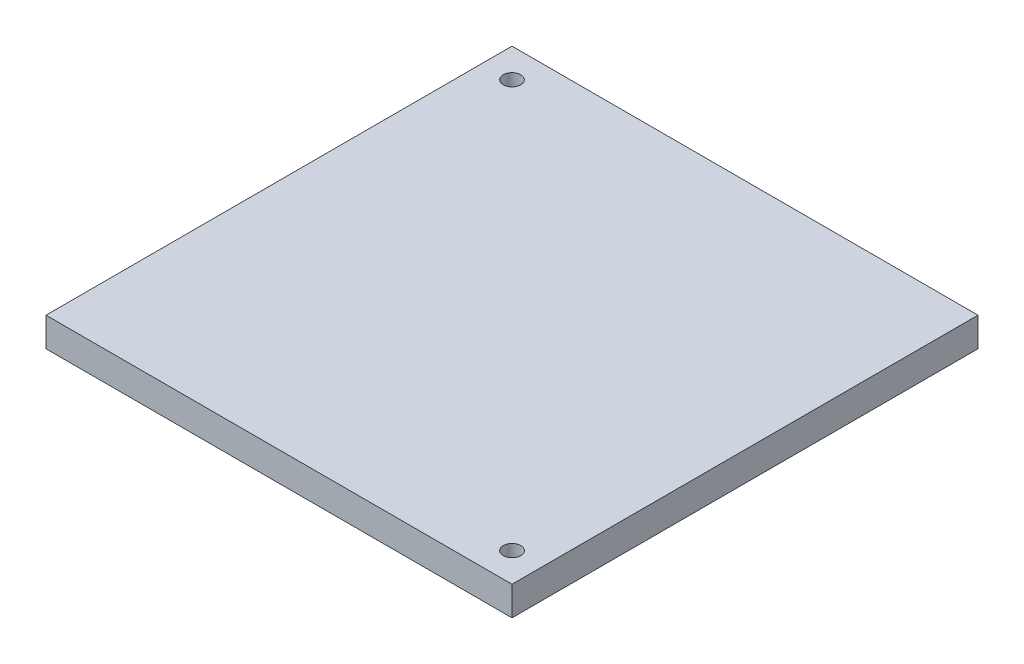
ISO-10303-21;
HEADER;
FILE_DESCRIPTION(('STEP AP214'),'2;1');
FILE_NAME('part.step','',(''),(''),'','','');
FILE_SCHEMA(('AUTOMOTIVE_DESIGN { 1 0 10303 214 1 1 1 1 }'));
ENDSEC;
DATA;
#1=APPLICATION_CONTEXT('core data for automotive mechanical design processes');
#2=APPLICATION_PROTOCOL_DEFINITION('international standard','automotive_design',2000,#1);
#3=PRODUCT_CONTEXT('',#1,'mechanical');
#4=PRODUCT('Part','Part','',(#3));
#5=PRODUCT_RELATED_PRODUCT_CATEGORY('part','',(#4));
#6=PRODUCT_DEFINITION_FORMATION('','',#4);
#7=PRODUCT_DEFINITION_CONTEXT('part definition',#1,'design');
#8=PRODUCT_DEFINITION('design','',#6,#7);
#9=PRODUCT_DEFINITION_SHAPE('','',#8);
#10=(LENGTH_UNIT() NAMED_UNIT(*) SI_UNIT(.MILLI.,.METRE.));
#11=(NAMED_UNIT(*) PLANE_ANGLE_UNIT() SI_UNIT($,.RADIAN.));
#12=(NAMED_UNIT(*) SI_UNIT($,.STERADIAN.) SOLID_ANGLE_UNIT());
#13=UNCERTAINTY_MEASURE_WITH_UNIT(LENGTH_MEASURE(1.E-05),#10,'distance_accuracy_value','');
#14=(GEOMETRIC_REPRESENTATION_CONTEXT(3) GLOBAL_UNCERTAINTY_ASSIGNED_CONTEXT((#13)) GLOBAL_UNIT_ASSIGNED_CONTEXT((#10,
#11,#12)) REPRESENTATION_CONTEXT('',''));
#15=CARTESIAN_POINT('',(0.,0.,0.));
#16=DIRECTION('',(0.,0.,1.));
#17=DIRECTION('',(1.,0.,0.));
#18=AXIS2_PLACEMENT_3D('',#15,#16,#17);
#19=CARTESIAN_POINT('',(-40.,5.,-40.));
#20=DIRECTION('',(1.,0.,0.));
#21=DIRECTION('',(0.,0.,-1.));
#22=AXIS2_PLACEMENT_3D('',#19,#20,#21);
#23=PLANE('',#22);
#24=DIRECTION('',(0.,0.,1.));
#25=VECTOR('',#24,1.);
#26=CARTESIAN_POINT('',(-40.,0.,-40.));
#27=LINE('',#26,#25);
#28=CARTESIAN_POINT('',(-40.,0.,-40.));
#29=VERTEX_POINT('',#28);
#30=CARTESIAN_POINT('',(-40.,0.,40.));
#31=VERTEX_POINT('',#30);
#32=EDGE_CURVE('E109',#29,#31,#27,.T.);
#33=ORIENTED_EDGE('',*,*,#32,.T.);
#34=DIRECTION('',(0.,-1.,0.));
#35=VECTOR('',#34,1.);
#36=CARTESIAN_POINT('',(-40.,5.,40.));
#37=LINE('',#36,#35);
#38=CARTESIAN_POINT('',(-40.,5.,40.));
#39=VERTEX_POINT('',#38);
#40=EDGE_CURVE('E13',#39,#31,#37,.T.);
#41=ORIENTED_EDGE('',*,*,#40,.F.);
#42=DIRECTION('',(0.,0.,1.));
#43=VECTOR('',#42,1.);
#44=CARTESIAN_POINT('',(-40.,5.,-40.));
#45=LINE('',#44,#43);
#46=CARTESIAN_POINT('',(-40.,5.,-40.));
#47=VERTEX_POINT('',#46);
#48=EDGE_CURVE('E97',#47,#39,#45,.T.);
#49=ORIENTED_EDGE('',*,*,#48,.F.);
#50=DIRECTION('',(0.,-1.,0.));
#51=VECTOR('',#50,1.);
#52=CARTESIAN_POINT('',(-40.,5.,-40.));
#53=LINE('',#52,#51);
#54=EDGE_CURVE('E105',#47,#29,#53,.T.);
#55=ORIENTED_EDGE('',*,*,#54,.T.);
#56=EDGE_LOOP('',(#33,#41,#49,#55));
#57=FACE_BOUND('',#56,.T.);
#58=ADVANCED_FACE('F46',(#57),#23,.F.);
#59=CARTESIAN_POINT('',(-40.,5.,40.));
#60=DIRECTION('',(0.,0.,-1.));
#61=DIRECTION('',(-1.,0.,0.));
#62=AXIS2_PLACEMENT_3D('',#59,#60,#61);
#63=PLANE('',#62);
#64=DIRECTION('',(1.,0.,0.));
#65=VECTOR('',#64,1.);
#66=CARTESIAN_POINT('',(-40.,0.,40.));
#67=LINE('',#66,#65);
#68=CARTESIAN_POINT('',(40.,0.,40.));
#69=VERTEX_POINT('',#68);
#70=EDGE_CURVE('E101',#31,#69,#67,.T.);
#71=ORIENTED_EDGE('',*,*,#70,.T.);
#72=DIRECTION('',(0.,-1.,0.));
#73=VECTOR('',#72,1.);
#74=CARTESIAN_POINT('',(40.,5.,40.));
#75=LINE('',#74,#73);
#76=CARTESIAN_POINT('',(40.,5.,40.));
#77=VERTEX_POINT('',#76);
#78=EDGE_CURVE('E54',#77,#69,#75,.T.);
#79=ORIENTED_EDGE('',*,*,#78,.F.);
#80=DIRECTION('',(1.,0.,0.));
#81=VECTOR('',#80,1.);
#82=CARTESIAN_POINT('',(-40.,5.,40.));
#83=LINE('',#82,#81);
#84=EDGE_CURVE('E92',#39,#77,#83,.T.);
#85=ORIENTED_EDGE('',*,*,#84,.F.);
#86=ORIENTED_EDGE('',*,*,#40,.T.);
#87=EDGE_LOOP('',(#71,#79,#85,#86));
#88=FACE_BOUND('',#87,.T.);
#89=ADVANCED_FACE('F100',(#88),#63,.F.);
#90=CARTESIAN_POINT('',(40.,5.,-40.));
#91=DIRECTION('',(-1.,0.,0.));
#92=DIRECTION('',(0.,0.,1.));
#93=AXIS2_PLACEMENT_3D('',#90,#91,#92);
#94=PLANE('',#93);
#95=DIRECTION('',(0.,0.,-1.));
#96=VECTOR('',#95,1.);
#97=CARTESIAN_POINT('',(40.,0.,-40.));
#98=LINE('',#97,#96);
#99=CARTESIAN_POINT('',(40.,0.,-40.));
#100=VERTEX_POINT('',#99);
#101=EDGE_CURVE('E79',#69,#100,#98,.T.);
#102=ORIENTED_EDGE('',*,*,#101,.T.);
#103=DIRECTION('',(0.,-1.,0.));
#104=VECTOR('',#103,1.);
#105=CARTESIAN_POINT('',(40.,5.,-40.));
#106=LINE('',#105,#104);
#107=CARTESIAN_POINT('',(40.,5.,-40.));
#108=VERTEX_POINT('',#107);
#109=EDGE_CURVE('E102',#108,#100,#106,.T.);
#110=ORIENTED_EDGE('',*,*,#109,.F.);
#111=DIRECTION('',(0.,0.,-1.));
#112=VECTOR('',#111,1.);
#113=CARTESIAN_POINT('',(40.,5.,-40.));
#114=LINE('',#113,#112);
#115=EDGE_CURVE('E95',#77,#108,#114,.T.);
#116=ORIENTED_EDGE('',*,*,#115,.F.);
#117=ORIENTED_EDGE('',*,*,#78,.T.);
#118=EDGE_LOOP('',(#102,#110,#116,#117));
#119=FACE_BOUND('',#118,.T.);
#120=ADVANCED_FACE('F103',(#119),#94,.F.);
#121=CARTESIAN_POINT('',(-40.,5.,-40.));
#122=DIRECTION('',(0.,0.,1.));
#123=DIRECTION('',(1.,0.,0.));
#124=AXIS2_PLACEMENT_3D('',#121,#122,#123);
#125=PLANE('',#124);
#126=DIRECTION('',(-1.,0.,0.));
#127=VECTOR('',#126,1.);
#128=CARTESIAN_POINT('',(-40.,0.,-40.));
#129=LINE('',#128,#127);
#130=EDGE_CURVE('E85',#100,#29,#129,.T.);
#131=ORIENTED_EDGE('',*,*,#130,.T.);
#132=ORIENTED_EDGE('',*,*,#54,.F.);
#133=DIRECTION('',(-1.,0.,0.));
#134=VECTOR('',#133,1.);
#135=CARTESIAN_POINT('',(-40.,5.,-40.));
#136=LINE('',#135,#134);
#137=EDGE_CURVE('E62',#108,#47,#136,.T.);
#138=ORIENTED_EDGE('',*,*,#137,.F.);
#139=ORIENTED_EDGE('',*,*,#109,.T.);
#140=EDGE_LOOP('',(#131,#132,#138,#139));
#141=FACE_BOUND('',#140,.T.);
#142=ADVANCED_FACE('F117',(#141),#125,.F.);
#143=CARTESIAN_POINT('',(0.,5.,0.));
#144=DIRECTION('',(0.,1.,0.));
#145=DIRECTION('',(0.,0.,1.));
#146=AXIS2_PLACEMENT_3D('',#143,#144,#145);
#147=PLANE('',#146);
#148=CARTESIAN_POINT('',(35.,5.,35.));
#149=DIRECTION('',(0.,1.,0.));
#150=DIRECTION('',(0.,0.,1.));
#151=AXIS2_PLACEMENT_3D('',#148,#149,#150);
#152=CIRCLE('',#151,1.5);
#153=CARTESIAN_POINT('',(35.,5.,36.5));
#154=VERTEX_POINT('',#153);
#155=EDGE_CURVE('E129',#154,#154,#152,.T.);
#156=ORIENTED_EDGE('',*,*,#155,.F.);
#157=EDGE_LOOP('',(#156));
#158=FACE_BOUND('',#157,.T.);
#159=CARTESIAN_POINT('',(-35.,5.,-35.));
#160=DIRECTION('',(0.,1.,0.));
#161=DIRECTION('',(0.,0.,1.));
#162=AXIS2_PLACEMENT_3D('',#159,#160,#161);
#163=CIRCLE('',#162,1.5);
#164=CARTESIAN_POINT('',(-35.,5.,-33.5));
#165=VERTEX_POINT('',#164);
#166=EDGE_CURVE('E123',#165,#165,#163,.T.);
#167=ORIENTED_EDGE('',*,*,#166,.F.);
#168=EDGE_LOOP('',(#167));
#169=FACE_BOUND('',#168,.T.);
#170=ORIENTED_EDGE('',*,*,#48,.T.);
#171=ORIENTED_EDGE('',*,*,#84,.T.);
#172=ORIENTED_EDGE('',*,*,#115,.T.);
#173=ORIENTED_EDGE('',*,*,#137,.T.);
#174=EDGE_LOOP('',(#170,#171,#172,#173));
#175=FACE_BOUND('',#174,.T.);
#176=ADVANCED_FACE('F93',(#158,#169,#175),#147,.T.);
#177=CARTESIAN_POINT('',(0.,0.,0.));
#178=DIRECTION('',(0.,1.,0.));
#179=DIRECTION('',(0.,0.,1.));
#180=AXIS2_PLACEMENT_3D('',#177,#178,#179);
#181=PLANE('',#180);
#182=CARTESIAN_POINT('',(35.,0.,35.));
#183=DIRECTION('',(0.,1.,0.));
#184=DIRECTION('',(0.,0.,1.));
#185=AXIS2_PLACEMENT_3D('',#182,#183,#184);
#186=CIRCLE('',#185,1.5);
#187=CARTESIAN_POINT('',(35.,0.,36.5));
#188=VERTEX_POINT('',#187);
#189=EDGE_CURVE('E126',#188,#188,#186,.T.);
#190=ORIENTED_EDGE('',*,*,#189,.T.);
#191=EDGE_LOOP('',(#190));
#192=FACE_BOUND('',#191,.T.);
#193=CARTESIAN_POINT('',(-35.,0.,-35.));
#194=DIRECTION('',(0.,1.,0.));
#195=DIRECTION('',(0.,0.,1.));
#196=AXIS2_PLACEMENT_3D('',#193,#194,#195);
#197=CIRCLE('',#196,1.5);
#198=CARTESIAN_POINT('',(-35.,0.,-33.5));
#199=VERTEX_POINT('',#198);
#200=EDGE_CURVE('E112',#199,#199,#197,.T.);
#201=ORIENTED_EDGE('',*,*,#200,.T.);
#202=EDGE_LOOP('',(#201));
#203=FACE_BOUND('',#202,.T.);
#204=ORIENTED_EDGE('',*,*,#32,.F.);
#205=ORIENTED_EDGE('',*,*,#130,.F.);
#206=ORIENTED_EDGE('',*,*,#101,.F.);
#207=ORIENTED_EDGE('',*,*,#70,.F.);
#208=EDGE_LOOP('',(#204,#205,#206,#207));
#209=FACE_BOUND('',#208,.T.);
#210=ADVANCED_FACE('F120',(#192,#203,#209),#181,.F.);
#211=CARTESIAN_POINT('',(-35.,0.,-35.));
#212=DIRECTION('',(0.,1.,0.));
#213=DIRECTION('',(0.,0.,1.));
#214=AXIS2_PLACEMENT_3D('',#211,#212,#213);
#215=CYLINDRICAL_SURFACE('',#214,1.5);
#216=ORIENTED_EDGE('',*,*,#200,.F.);
#217=EDGE_LOOP('',(#216));
#218=FACE_BOUND('',#217,.T.);
#219=ORIENTED_EDGE('',*,*,#166,.T.);
#220=EDGE_LOOP('',(#219));
#221=FACE_BOUND('',#220,.T.);
#222=ADVANCED_FACE('F140',(#218,#221),#215,.F.);
#223=CARTESIAN_POINT('',(35.,0.,35.));
#224=DIRECTION('',(0.,1.,0.));
#225=DIRECTION('',(0.,0.,1.));
#226=AXIS2_PLACEMENT_3D('',#223,#224,#225);
#227=CYLINDRICAL_SURFACE('',#226,1.5);
#228=ORIENTED_EDGE('',*,*,#189,.F.);
#229=EDGE_LOOP('',(#228));
#230=FACE_BOUND('',#229,.T.);
#231=ORIENTED_EDGE('',*,*,#155,.T.);
#232=EDGE_LOOP('',(#231));
#233=FACE_BOUND('',#232,.T.);
#234=ADVANCED_FACE('F137',(#230,#233),#227,.F.);
#235=CLOSED_SHELL('',(#58,#89,#120,#142,#176,#210,#222,#234));
#236=MANIFOLD_SOLID_BREP('B2',#235);
#237=ADVANCED_BREP_SHAPE_REPRESENTATION('',(#18,#236),#14);
#238=SHAPE_DEFINITION_REPRESENTATION(#9,#237);
ENDSEC;
END-ISO-10303-21;
